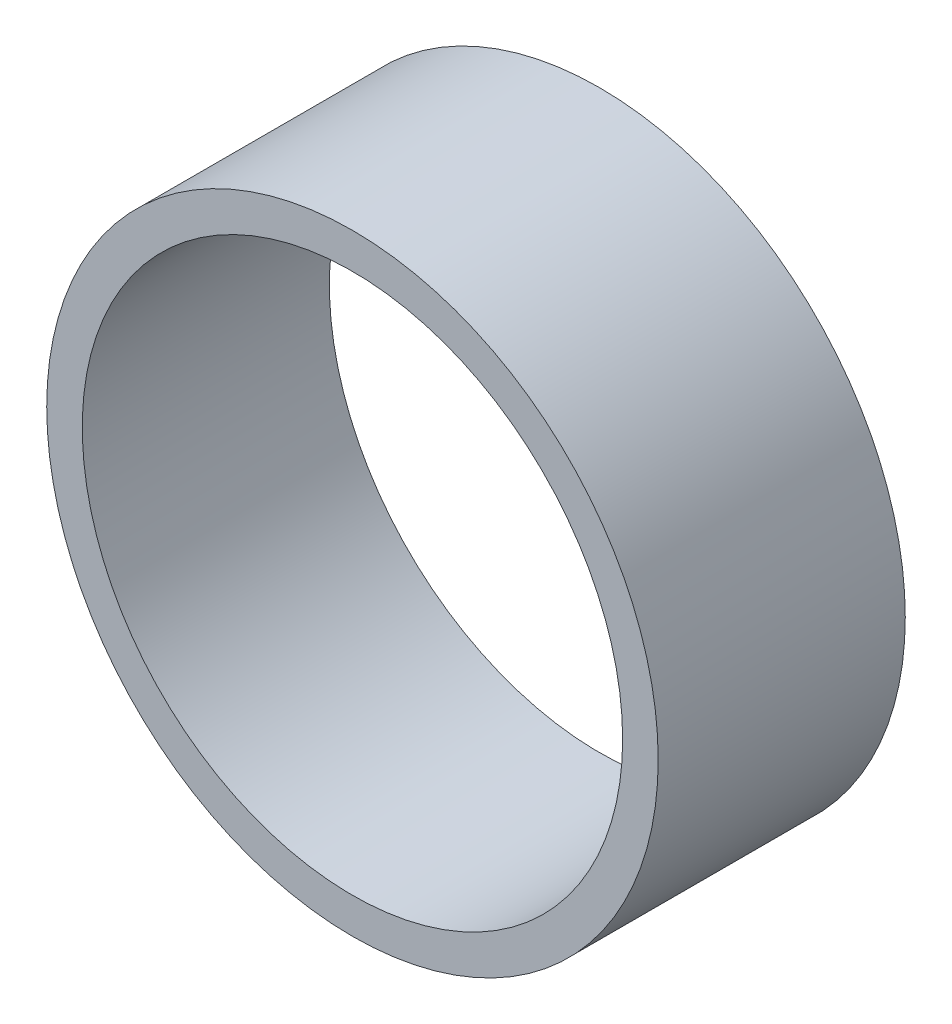
ISO-10303-21;
HEADER;
FILE_DESCRIPTION(('STEP AP214'),'2;1');
FILE_NAME('part.step','',(''),(''),'','','');
FILE_SCHEMA(('AUTOMOTIVE_DESIGN { 1 0 10303 214 1 1 1 1 }'));
ENDSEC;
DATA;
#1=APPLICATION_CONTEXT('core data for automotive mechanical design processes');
#2=APPLICATION_PROTOCOL_DEFINITION('international standard','automotive_design',2000,#1);
#3=PRODUCT_CONTEXT('',#1,'mechanical');
#4=PRODUCT('Part','Part','',(#3));
#5=PRODUCT_RELATED_PRODUCT_CATEGORY('part','',(#4));
#6=PRODUCT_DEFINITION_FORMATION('','',#4);
#7=PRODUCT_DEFINITION_CONTEXT('part definition',#1,'design');
#8=PRODUCT_DEFINITION('design','',#6,#7);
#9=PRODUCT_DEFINITION_SHAPE('','',#8);
#10=(LENGTH_UNIT() NAMED_UNIT(*) SI_UNIT(.MILLI.,.METRE.));
#11=(NAMED_UNIT(*) PLANE_ANGLE_UNIT() SI_UNIT($,.RADIAN.));
#12=(NAMED_UNIT(*) SI_UNIT($,.STERADIAN.) SOLID_ANGLE_UNIT());
#13=UNCERTAINTY_MEASURE_WITH_UNIT(LENGTH_MEASURE(1.E-05),#10,'distance_accuracy_value','');
#14=(GEOMETRIC_REPRESENTATION_CONTEXT(3) GLOBAL_UNCERTAINTY_ASSIGNED_CONTEXT((#13)) GLOBAL_UNIT_ASSIGNED_CONTEXT((#10,
#11,#12)) REPRESENTATION_CONTEXT('',''));
#15=CARTESIAN_POINT('',(0.,0.,0.));
#16=DIRECTION('',(0.,0.,1.));
#17=DIRECTION('',(1.,0.,0.));
#18=AXIS2_PLACEMENT_3D('',#15,#16,#17);
#19=CARTESIAN_POINT('',(0.,0.,69.5));
#20=DIRECTION('',(0.,0.,1.));
#21=DIRECTION('',(1.,0.,0.));
#22=AXIS2_PLACEMENT_3D('',#19,#20,#21);
#23=PLANE('',#22);
#24=CARTESIAN_POINT('',(0.,0.,69.5));
#25=DIRECTION('',(0.,0.,1.));
#26=DIRECTION('',(1.,0.,0.));
#27=AXIS2_PLACEMENT_3D('',#24,#25,#26);
#28=CIRCLE('',#27,86.);
#29=CARTESIAN_POINT('',(86.,0.,69.5));
#30=VERTEX_POINT('',#29);
#31=EDGE_CURVE('E10',#30,#30,#28,.T.);
#32=ORIENTED_EDGE('',*,*,#31,.T.);
#33=EDGE_LOOP('',(#32));
#34=FACE_BOUND('',#33,.T.);
#35=CARTESIAN_POINT('',(0.,0.,69.5));
#36=DIRECTION('',(0.,0.,1.));
#37=DIRECTION('',(1.,0.,0.));
#38=AXIS2_PLACEMENT_3D('',#35,#36,#37);
#39=CIRCLE('',#38,76.);
#40=CARTESIAN_POINT('',(76.,0.,69.5));
#41=VERTEX_POINT('',#40);
#42=EDGE_CURVE('E44',#41,#41,#39,.T.);
#43=ORIENTED_EDGE('',*,*,#42,.F.);
#44=EDGE_LOOP('',(#43));
#45=FACE_BOUND('',#44,.T.);
#46=ADVANCED_FACE('F33',(#34,#45),#23,.T.);
#47=CARTESIAN_POINT('',(0.,0.,0.));
#48=DIRECTION('',(0.,0.,1.));
#49=DIRECTION('',(1.,0.,0.));
#50=AXIS2_PLACEMENT_3D('',#47,#48,#49);
#51=PLANE('',#50);
#52=CARTESIAN_POINT('',(0.,0.,0.));
#53=DIRECTION('',(0.,0.,1.));
#54=DIRECTION('',(1.,0.,0.));
#55=AXIS2_PLACEMENT_3D('',#52,#53,#54);
#56=CIRCLE('',#55,86.);
#57=CARTESIAN_POINT('',(86.,0.,0.));
#58=VERTEX_POINT('',#57);
#59=EDGE_CURVE('E37',#58,#58,#56,.T.);
#60=ORIENTED_EDGE('',*,*,#59,.F.);
#61=EDGE_LOOP('',(#60));
#62=FACE_BOUND('',#61,.T.);
#63=CARTESIAN_POINT('',(0.,0.,0.));
#64=DIRECTION('',(0.,0.,1.));
#65=DIRECTION('',(1.,0.,0.));
#66=AXIS2_PLACEMENT_3D('',#63,#64,#65);
#67=CIRCLE('',#66,76.);
#68=CARTESIAN_POINT('',(76.,0.,0.));
#69=VERTEX_POINT('',#68);
#70=EDGE_CURVE('E46',#69,#69,#67,.T.);
#71=ORIENTED_EDGE('',*,*,#70,.T.);
#72=EDGE_LOOP('',(#71));
#73=FACE_BOUND('',#72,.T.);
#74=ADVANCED_FACE('F56',(#62,#73),#51,.F.);
#75=CARTESIAN_POINT('',(0.,0.,69.5));
#76=DIRECTION('',(0.,0.,-1.));
#77=DIRECTION('',(-1.,0.,0.));
#78=AXIS2_PLACEMENT_3D('',#75,#76,#77);
#79=CYLINDRICAL_SURFACE('',#78,86.);
#80=ORIENTED_EDGE('',*,*,#31,.F.);
#81=EDGE_LOOP('',(#80));
#82=FACE_BOUND('',#81,.T.);
#83=ORIENTED_EDGE('',*,*,#59,.T.);
#84=EDGE_LOOP('',(#83));
#85=FACE_BOUND('',#84,.T.);
#86=ADVANCED_FACE('F35',(#82,#85),#79,.T.);
#87=CARTESIAN_POINT('',(0.,0.,69.5));
#88=DIRECTION('',(0.,0.,-1.));
#89=DIRECTION('',(-1.,0.,0.));
#90=AXIS2_PLACEMENT_3D('',#87,#88,#89);
#91=CYLINDRICAL_SURFACE('',#90,76.);
#92=ORIENTED_EDGE('',*,*,#42,.T.);
#93=EDGE_LOOP('',(#92));
#94=FACE_BOUND('',#93,.T.);
#95=ORIENTED_EDGE('',*,*,#70,.F.);
#96=EDGE_LOOP('',(#95));
#97=FACE_BOUND('',#96,.T.);
#98=ADVANCED_FACE('F52',(#94,#97),#91,.F.);
#99=CLOSED_SHELL('',(#46,#74,#86,#98));
#100=MANIFOLD_SOLID_BREP('B2',#99);
#101=ADVANCED_BREP_SHAPE_REPRESENTATION('',(#18,#100),#14);
#102=SHAPE_DEFINITION_REPRESENTATION(#9,#101);
ENDSEC;
END-ISO-10303-21;
